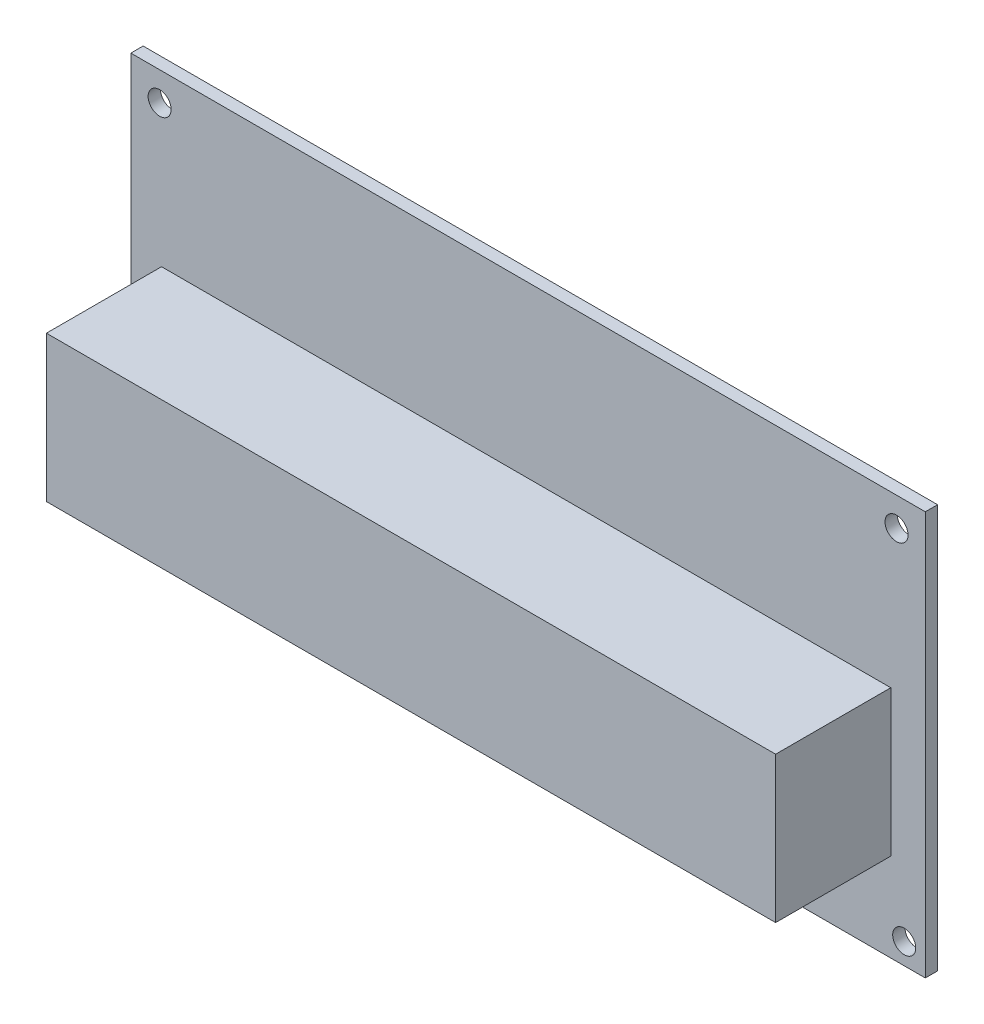
ISO-10303-21;
HEADER;
FILE_DESCRIPTION(('STEP AP214'),'2;1');
FILE_NAME('part.step','',(''),(''),'','','');
FILE_SCHEMA(('AUTOMOTIVE_DESIGN { 1 0 10303 214 1 1 1 1 }'));
ENDSEC;
DATA;
#1=APPLICATION_CONTEXT('core data for automotive mechanical design processes');
#2=APPLICATION_PROTOCOL_DEFINITION('international standard','automotive_design',2000,#1);
#3=PRODUCT_CONTEXT('',#1,'mechanical');
#4=PRODUCT('Part','Part','',(#3));
#5=PRODUCT_RELATED_PRODUCT_CATEGORY('part','',(#4));
#6=PRODUCT_DEFINITION_FORMATION('','',#4);
#7=PRODUCT_DEFINITION_CONTEXT('part definition',#1,'design');
#8=PRODUCT_DEFINITION('design','',#6,#7);
#9=PRODUCT_DEFINITION_SHAPE('','',#8);
#10=(LENGTH_UNIT() NAMED_UNIT(*) SI_UNIT(.MILLI.,.METRE.));
#11=(NAMED_UNIT(*) PLANE_ANGLE_UNIT() SI_UNIT($,.RADIAN.));
#12=(NAMED_UNIT(*) SI_UNIT($,.STERADIAN.) SOLID_ANGLE_UNIT());
#13=UNCERTAINTY_MEASURE_WITH_UNIT(LENGTH_MEASURE(1.E-05),#10,'distance_accuracy_value','');
#14=(GEOMETRIC_REPRESENTATION_CONTEXT(3) GLOBAL_UNCERTAINTY_ASSIGNED_CONTEXT((#13)) GLOBAL_UNIT_ASSIGNED_CONTEXT((#10,
#11,#12)) REPRESENTATION_CONTEXT('',''));
#15=CARTESIAN_POINT('',(0.,0.,0.));
#16=DIRECTION('',(0.,0.,1.));
#17=DIRECTION('',(1.,0.,0.));
#18=AXIS2_PLACEMENT_3D('',#15,#16,#17);
#19=CARTESIAN_POINT('',(0.,0.,1.6));
#20=DIRECTION('',(0.,0.,-1.));
#21=DIRECTION('',(-1.,0.,0.));
#22=AXIS2_PLACEMENT_3D('',#19,#20,#21);
#23=PLANE('',#22);
#24=CARTESIAN_POINT('',(-48.,22.55,1.6));
#25=DIRECTION('',(0.,0.,1.));
#26=DIRECTION('',(-1.,0.,0.));
#27=AXIS2_PLACEMENT_3D('',#24,#25,#26);
#28=CIRCLE('',#27,1.5);
#29=CARTESIAN_POINT('',(-49.5,22.55,1.6));
#30=VERTEX_POINT('',#29);
#31=EDGE_CURVE('E123',#30,#30,#28,.T.);
#32=ORIENTED_EDGE('',*,*,#31,.F.);
#33=EDGE_LOOP('',(#32));
#34=FACE_BOUND('',#33,.T.);
#35=CARTESIAN_POINT('',(-49.,-23.55,1.6));
#36=DIRECTION('',(0.,0.,1.));
#37=DIRECTION('',(1.,0.,0.));
#38=AXIS2_PLACEMENT_3D('',#35,#36,#37);
#39=CIRCLE('',#38,1.5);
#40=CARTESIAN_POINT('',(-47.5,-23.55,1.6));
#41=VERTEX_POINT('',#40);
#42=EDGE_CURVE('E132',#41,#41,#39,.T.);
#43=ORIENTED_EDGE('',*,*,#42,.F.);
#44=EDGE_LOOP('',(#43));
#45=FACE_BOUND('',#44,.T.);
#46=CARTESIAN_POINT('',(49.,-23.55,1.6));
#47=DIRECTION('',(0.,0.,1.));
#48=DIRECTION('',(-1.,0.,0.));
#49=AXIS2_PLACEMENT_3D('',#46,#47,#48);
#50=CIRCLE('',#49,1.5);
#51=CARTESIAN_POINT('',(47.5,-23.55,1.6));
#52=VERTEX_POINT('',#51);
#53=EDGE_CURVE('E138',#52,#52,#50,.T.);
#54=ORIENTED_EDGE('',*,*,#53,.F.);
#55=EDGE_LOOP('',(#54));
#56=FACE_BOUND('',#55,.T.);
#57=CARTESIAN_POINT('',(48.,22.55,1.6));
#58=DIRECTION('',(0.,0.,1.));
#59=DIRECTION('',(1.,0.,0.));
#60=AXIS2_PLACEMENT_3D('',#57,#58,#59);
#61=CIRCLE('',#60,1.5);
#62=CARTESIAN_POINT('',(49.5,22.55,1.6));
#63=VERTEX_POINT('',#62);
#64=EDGE_CURVE('E144',#63,#63,#61,.T.);
#65=ORIENTED_EDGE('',*,*,#64,.F.);
#66=EDGE_LOOP('',(#65));
#67=FACE_BOUND('',#66,.T.);
#68=DIRECTION('',(0.,1.,0.));
#69=VECTOR('',#68,1.);
#70=CARTESIAN_POINT('',(51.75,-26.3,1.6));
#71=LINE('',#70,#69);
#72=CARTESIAN_POINT('',(51.75,-26.3,1.6));
#73=VERTEX_POINT('',#72);
#74=CARTESIAN_POINT('',(51.75,26.3,1.6));
#75=VERTEX_POINT('',#74);
#76=EDGE_CURVE('E150',#73,#75,#71,.T.);
#77=ORIENTED_EDGE('',*,*,#76,.T.);
#78=DIRECTION('',(-1.,0.,0.));
#79=VECTOR('',#78,1.);
#80=CARTESIAN_POINT('',(-51.75,26.3,1.6));
#81=LINE('',#80,#79);
#82=CARTESIAN_POINT('',(-51.75,26.3,1.6));
#83=VERTEX_POINT('',#82);
#84=EDGE_CURVE('E153',#75,#83,#81,.T.);
#85=ORIENTED_EDGE('',*,*,#84,.T.);
#86=DIRECTION('',(0.,-1.,0.));
#87=VECTOR('',#86,1.);
#88=CARTESIAN_POINT('',(-51.75,-26.3,1.6));
#89=LINE('',#88,#87);
#90=CARTESIAN_POINT('',(-51.75,-26.3,1.6));
#91=VERTEX_POINT('',#90);
#92=EDGE_CURVE('E156',#83,#91,#89,.T.);
#93=ORIENTED_EDGE('',*,*,#92,.T.);
#94=DIRECTION('',(1.,0.,0.));
#95=VECTOR('',#94,1.);
#96=CARTESIAN_POINT('',(-51.75,-26.3,1.6));
#97=LINE('',#96,#95);
#98=EDGE_CURVE('E158',#91,#73,#97,.T.);
#99=ORIENTED_EDGE('',*,*,#98,.T.);
#100=EDGE_LOOP('',(#77,#85,#93,#99));
#101=FACE_BOUND('',#100,.T.);
#102=DIRECTION('',(0.,-1.,0.));
#103=VECTOR('',#102,1.);
#104=CARTESIAN_POINT('',(-47.75,-14.8,1.6));
#105=LINE('',#104,#103);
#106=CARTESIAN_POINT('',(-47.75,4.2,1.6));
#107=VERTEX_POINT('',#106);
#108=CARTESIAN_POINT('',(-47.75,-14.8,1.6));
#109=VERTEX_POINT('',#108);
#110=EDGE_CURVE('E50',#107,#109,#105,.T.);
#111=ORIENTED_EDGE('',*,*,#110,.F.);
#112=DIRECTION('',(-1.,0.,0.));
#113=VECTOR('',#112,1.);
#114=CARTESIAN_POINT('',(-47.75,4.2,1.6));
#115=LINE('',#114,#113);
#116=CARTESIAN_POINT('',(47.25,4.2,1.6));
#117=VERTEX_POINT('',#116);
#118=EDGE_CURVE('E54',#117,#107,#115,.T.);
#119=ORIENTED_EDGE('',*,*,#118,.F.);
#120=DIRECTION('',(0.,1.,0.));
#121=VECTOR('',#120,1.);
#122=CARTESIAN_POINT('',(47.25,-14.8,1.6));
#123=LINE('',#122,#121);
#124=CARTESIAN_POINT('',(47.25,-14.8,1.6));
#125=VERTEX_POINT('',#124);
#126=EDGE_CURVE('E337',#125,#117,#123,.T.);
#127=ORIENTED_EDGE('',*,*,#126,.F.);
#128=DIRECTION('',(1.,0.,0.));
#129=VECTOR('',#128,1.);
#130=CARTESIAN_POINT('',(-47.75,-14.8,1.6));
#131=LINE('',#130,#129);
#132=EDGE_CURVE('E343',#109,#125,#131,.T.);
#133=ORIENTED_EDGE('',*,*,#132,.F.);
#134=EDGE_LOOP('',(#111,#119,#127,#133));
#135=FACE_BOUND('',#134,.T.);
#136=ADVANCED_FACE('F35',(#34,#45,#56,#67,#101,#135),#23,.F.);
#137=CARTESIAN_POINT('',(0.,0.,0.));
#138=DIRECTION('',(0.,0.,-1.));
#139=DIRECTION('',(-1.,0.,0.));
#140=AXIS2_PLACEMENT_3D('',#137,#138,#139);
#141=PLANE('',#140);
#142=CARTESIAN_POINT('',(-49.,-23.55,0.));
#143=DIRECTION('',(0.,0.,1.));
#144=DIRECTION('',(1.,0.,0.));
#145=AXIS2_PLACEMENT_3D('',#142,#143,#144);
#146=CIRCLE('',#145,1.5);
#147=CARTESIAN_POINT('',(-47.5,-23.55,0.));
#148=VERTEX_POINT('',#147);
#149=EDGE_CURVE('E130',#148,#148,#146,.T.);
#150=ORIENTED_EDGE('',*,*,#149,.T.);
#151=EDGE_LOOP('',(#150));
#152=FACE_BOUND('',#151,.T.);
#153=CARTESIAN_POINT('',(48.,22.55,0.));
#154=DIRECTION('',(0.,0.,1.));
#155=DIRECTION('',(1.,0.,0.));
#156=AXIS2_PLACEMENT_3D('',#153,#154,#155);
#157=CIRCLE('',#156,1.5);
#158=CARTESIAN_POINT('',(49.5,22.55,0.));
#159=VERTEX_POINT('',#158);
#160=EDGE_CURVE('E141',#159,#159,#157,.T.);
#161=ORIENTED_EDGE('',*,*,#160,.T.);
#162=EDGE_LOOP('',(#161));
#163=FACE_BOUND('',#162,.T.);
#164=DIRECTION('',(0.,1.,0.));
#165=VECTOR('',#164,1.);
#166=CARTESIAN_POINT('',(51.75,-26.3,0.));
#167=LINE('',#166,#165);
#168=CARTESIAN_POINT('',(51.75,-26.3,0.));
#169=VERTEX_POINT('',#168);
#170=CARTESIAN_POINT('',(51.75,26.3,0.));
#171=VERTEX_POINT('',#170);
#172=EDGE_CURVE('E147',#169,#171,#167,.T.);
#173=ORIENTED_EDGE('',*,*,#172,.F.);
#174=DIRECTION('',(1.,0.,0.));
#175=VECTOR('',#174,1.);
#176=CARTESIAN_POINT('',(-51.75,-26.3,0.));
#177=LINE('',#176,#175);
#178=CARTESIAN_POINT('',(-51.75,-26.3,0.));
#179=VERTEX_POINT('',#178);
#180=EDGE_CURVE('E154',#179,#169,#177,.T.);
#181=ORIENTED_EDGE('',*,*,#180,.F.);
#182=DIRECTION('',(0.,-1.,0.));
#183=VECTOR('',#182,1.);
#184=CARTESIAN_POINT('',(-51.75,-26.3,0.));
#185=LINE('',#184,#183);
#186=CARTESIAN_POINT('',(-51.75,26.3,0.));
#187=VERTEX_POINT('',#186);
#188=EDGE_CURVE('E165',#187,#179,#185,.T.);
#189=ORIENTED_EDGE('',*,*,#188,.F.);
#190=DIRECTION('',(-1.,0.,0.));
#191=VECTOR('',#190,1.);
#192=CARTESIAN_POINT('',(-51.75,26.3,0.));
#193=LINE('',#192,#191);
#194=EDGE_CURVE('E163',#171,#187,#193,.T.);
#195=ORIENTED_EDGE('',*,*,#194,.F.);
#196=EDGE_LOOP('',(#173,#181,#189,#195));
#197=FACE_BOUND('',#196,.T.);
#198=CARTESIAN_POINT('',(49.,-23.55,0.));
#199=DIRECTION('',(0.,0.,1.));
#200=DIRECTION('',(-1.,0.,0.));
#201=AXIS2_PLACEMENT_3D('',#198,#199,#200);
#202=CIRCLE('',#201,1.5);
#203=CARTESIAN_POINT('',(47.5,-23.55,0.));
#204=VERTEX_POINT('',#203);
#205=EDGE_CURVE('E135',#204,#204,#202,.T.);
#206=ORIENTED_EDGE('',*,*,#205,.T.);
#207=EDGE_LOOP('',(#206));
#208=FACE_BOUND('',#207,.T.);
#209=CARTESIAN_POINT('',(-48.,22.55,0.));
#210=DIRECTION('',(0.,0.,1.));
#211=DIRECTION('',(-1.,0.,0.));
#212=AXIS2_PLACEMENT_3D('',#209,#210,#211);
#213=CIRCLE('',#212,1.5);
#214=CARTESIAN_POINT('',(-49.5,22.55,0.));
#215=VERTEX_POINT('',#214);
#216=EDGE_CURVE('E120',#215,#215,#213,.T.);
#217=ORIENTED_EDGE('',*,*,#216,.T.);
#218=EDGE_LOOP('',(#217));
#219=FACE_BOUND('',#218,.T.);
#220=ADVANCED_FACE('F183',(#152,#163,#197,#208,#219),#141,.T.);
#221=CARTESIAN_POINT('',(51.75,-26.3,1.6));
#222=DIRECTION('',(-1.,0.,0.));
#223=DIRECTION('',(0.,0.,1.));
#224=AXIS2_PLACEMENT_3D('',#221,#222,#223);
#225=PLANE('',#224);
#226=ORIENTED_EDGE('',*,*,#172,.T.);
#227=DIRECTION('',(0.,0.,-1.));
#228=VECTOR('',#227,1.);
#229=CARTESIAN_POINT('',(51.75,26.3,1.6));
#230=LINE('',#229,#228);
#231=EDGE_CURVE('E11',#75,#171,#230,.T.);
#232=ORIENTED_EDGE('',*,*,#231,.F.);
#233=ORIENTED_EDGE('',*,*,#76,.F.);
#234=DIRECTION('',(0.,0.,-1.));
#235=VECTOR('',#234,1.);
#236=CARTESIAN_POINT('',(51.75,-26.3,1.6));
#237=LINE('',#236,#235);
#238=EDGE_CURVE('E160',#73,#169,#237,.T.);
#239=ORIENTED_EDGE('',*,*,#238,.T.);
#240=EDGE_LOOP('',(#226,#232,#233,#239));
#241=FACE_BOUND('',#240,.T.);
#242=ADVANCED_FACE('F37',(#241),#225,.F.);
#243=CARTESIAN_POINT('',(-51.75,26.3,1.6));
#244=DIRECTION('',(0.,-1.,0.));
#245=DIRECTION('',(0.,0.,-1.));
#246=AXIS2_PLACEMENT_3D('',#243,#244,#245);
#247=PLANE('',#246);
#248=ORIENTED_EDGE('',*,*,#194,.T.);
#249=DIRECTION('',(0.,0.,-1.));
#250=VECTOR('',#249,1.);
#251=CARTESIAN_POINT('',(-51.75,26.3,1.6));
#252=LINE('',#251,#250);
#253=EDGE_CURVE('E43',#83,#187,#252,.T.);
#254=ORIENTED_EDGE('',*,*,#253,.F.);
#255=ORIENTED_EDGE('',*,*,#84,.F.);
#256=ORIENTED_EDGE('',*,*,#231,.T.);
#257=EDGE_LOOP('',(#248,#254,#255,#256));
#258=FACE_BOUND('',#257,.T.);
#259=ADVANCED_FACE('F193',(#258),#247,.F.);
#260=CARTESIAN_POINT('',(-51.75,-26.3,1.6));
#261=DIRECTION('',(1.,0.,0.));
#262=DIRECTION('',(0.,0.,-1.));
#263=AXIS2_PLACEMENT_3D('',#260,#261,#262);
#264=PLANE('',#263);
#265=ORIENTED_EDGE('',*,*,#188,.T.);
#266=DIRECTION('',(0.,0.,-1.));
#267=VECTOR('',#266,1.);
#268=CARTESIAN_POINT('',(-51.75,-26.3,1.6));
#269=LINE('',#268,#267);
#270=EDGE_CURVE('E170',#91,#179,#269,.T.);
#271=ORIENTED_EDGE('',*,*,#270,.F.);
#272=ORIENTED_EDGE('',*,*,#92,.F.);
#273=ORIENTED_EDGE('',*,*,#253,.T.);
#274=EDGE_LOOP('',(#265,#271,#272,#273));
#275=FACE_BOUND('',#274,.T.);
#276=ADVANCED_FACE('F177',(#275),#264,.F.);
#277=CARTESIAN_POINT('',(-51.75,-26.3,1.6));
#278=DIRECTION('',(0.,1.,0.));
#279=DIRECTION('',(0.,0.,1.));
#280=AXIS2_PLACEMENT_3D('',#277,#278,#279);
#281=PLANE('',#280);
#282=ORIENTED_EDGE('',*,*,#180,.T.);
#283=ORIENTED_EDGE('',*,*,#238,.F.);
#284=ORIENTED_EDGE('',*,*,#98,.F.);
#285=ORIENTED_EDGE('',*,*,#270,.T.);
#286=EDGE_LOOP('',(#282,#283,#284,#285));
#287=FACE_BOUND('',#286,.T.);
#288=ADVANCED_FACE('F187',(#287),#281,.F.);
#289=CARTESIAN_POINT('',(48.,22.55,1.6));
#290=DIRECTION('',(0.,0.,-1.));
#291=DIRECTION('',(-1.,0.,0.));
#292=AXIS2_PLACEMENT_3D('',#289,#290,#291);
#293=CYLINDRICAL_SURFACE('',#292,1.5);
#294=ORIENTED_EDGE('',*,*,#64,.T.);
#295=EDGE_LOOP('',(#294));
#296=FACE_BOUND('',#295,.T.);
#297=ORIENTED_EDGE('',*,*,#160,.F.);
#298=EDGE_LOOP('',(#297));
#299=FACE_BOUND('',#298,.T.);
#300=ADVANCED_FACE('F211',(#296,#299),#293,.F.);
#301=CARTESIAN_POINT('',(49.,-23.55,1.6));
#302=DIRECTION('',(0.,0.,-1.));
#303=DIRECTION('',(-1.,0.,0.));
#304=AXIS2_PLACEMENT_3D('',#301,#302,#303);
#305=CYLINDRICAL_SURFACE('',#304,1.5);
#306=ORIENTED_EDGE('',*,*,#53,.T.);
#307=EDGE_LOOP('',(#306));
#308=FACE_BOUND('',#307,.T.);
#309=ORIENTED_EDGE('',*,*,#205,.F.);
#310=EDGE_LOOP('',(#309));
#311=FACE_BOUND('',#310,.T.);
#312=ADVANCED_FACE('F218',(#308,#311),#305,.F.);
#313=CARTESIAN_POINT('',(-49.,-23.55,1.6));
#314=DIRECTION('',(0.,0.,-1.));
#315=DIRECTION('',(-1.,0.,0.));
#316=AXIS2_PLACEMENT_3D('',#313,#314,#315);
#317=CYLINDRICAL_SURFACE('',#316,1.5);
#318=ORIENTED_EDGE('',*,*,#42,.T.);
#319=EDGE_LOOP('',(#318));
#320=FACE_BOUND('',#319,.T.);
#321=ORIENTED_EDGE('',*,*,#149,.F.);
#322=EDGE_LOOP('',(#321));
#323=FACE_BOUND('',#322,.T.);
#324=ADVANCED_FACE('F223',(#320,#323),#317,.F.);
#325=CARTESIAN_POINT('',(-48.,22.55,1.6));
#326=DIRECTION('',(0.,0.,-1.));
#327=DIRECTION('',(-1.,0.,0.));
#328=AXIS2_PLACEMENT_3D('',#325,#326,#327);
#329=CYLINDRICAL_SURFACE('',#328,1.5);
#330=ORIENTED_EDGE('',*,*,#31,.T.);
#331=EDGE_LOOP('',(#330));
#332=FACE_BOUND('',#331,.T.);
#333=ORIENTED_EDGE('',*,*,#216,.F.);
#334=EDGE_LOOP('',(#333));
#335=FACE_BOUND('',#334,.T.);
#336=ADVANCED_FACE('F233',(#332,#335),#329,.F.);
#337=CARTESIAN_POINT('',(-47.75,-14.8,16.6));
#338=DIRECTION('',(1.,0.,0.));
#339=DIRECTION('',(0.,0.,-1.));
#340=AXIS2_PLACEMENT_3D('',#337,#338,#339);
#341=PLANE('',#340);
#342=ORIENTED_EDGE('',*,*,#110,.T.);
#343=DIRECTION('',(0.,0.,-1.));
#344=VECTOR('',#343,1.);
#345=CARTESIAN_POINT('',(-47.75,-14.8,16.6));
#346=LINE('',#345,#344);
#347=CARTESIAN_POINT('',(-47.75,-14.8,16.6));
#348=VERTEX_POINT('',#347);
#349=EDGE_CURVE('E103',#348,#109,#346,.T.);
#350=ORIENTED_EDGE('',*,*,#349,.F.);
#351=DIRECTION('',(0.,-1.,0.));
#352=VECTOR('',#351,1.);
#353=CARTESIAN_POINT('',(-47.75,-14.8,16.6));
#354=LINE('',#353,#352);
#355=CARTESIAN_POINT('',(-47.75,4.2,16.6));
#356=VERTEX_POINT('',#355);
#357=EDGE_CURVE('E109',#356,#348,#354,.T.);
#358=ORIENTED_EDGE('',*,*,#357,.F.);
#359=DIRECTION('',(0.,0.,-1.));
#360=VECTOR('',#359,1.);
#361=CARTESIAN_POINT('',(-47.75,4.2,16.6));
#362=LINE('',#361,#360);
#363=EDGE_CURVE('E335',#356,#107,#362,.T.);
#364=ORIENTED_EDGE('',*,*,#363,.T.);
#365=EDGE_LOOP('',(#342,#350,#358,#364));
#366=FACE_BOUND('',#365,.T.);
#367=ADVANCED_FACE('F119',(#366),#341,.F.);
#368=CARTESIAN_POINT('',(-47.75,-14.8,16.6));
#369=DIRECTION('',(0.,1.,0.));
#370=DIRECTION('',(0.,0.,1.));
#371=AXIS2_PLACEMENT_3D('',#368,#369,#370);
#372=PLANE('',#371);
#373=ORIENTED_EDGE('',*,*,#132,.T.);
#374=DIRECTION('',(0.,0.,-1.));
#375=VECTOR('',#374,1.);
#376=CARTESIAN_POINT('',(47.25,-14.8,16.6));
#377=LINE('',#376,#375);
#378=CARTESIAN_POINT('',(47.25,-14.8,16.6));
#379=VERTEX_POINT('',#378);
#380=EDGE_CURVE('E105',#379,#125,#377,.T.);
#381=ORIENTED_EDGE('',*,*,#380,.F.);
#382=DIRECTION('',(1.,0.,0.));
#383=VECTOR('',#382,1.);
#384=CARTESIAN_POINT('',(-47.75,-14.8,16.6));
#385=LINE('',#384,#383);
#386=EDGE_CURVE('E98',#348,#379,#385,.T.);
#387=ORIENTED_EDGE('',*,*,#386,.F.);
#388=ORIENTED_EDGE('',*,*,#349,.T.);
#389=EDGE_LOOP('',(#373,#381,#387,#388));
#390=FACE_BOUND('',#389,.T.);
#391=ADVANCED_FACE('F101',(#390),#372,.F.);
#392=CARTESIAN_POINT('',(47.25,-14.8,16.6));
#393=DIRECTION('',(-1.,0.,0.));
#394=DIRECTION('',(0.,0.,1.));
#395=AXIS2_PLACEMENT_3D('',#392,#393,#394);
#396=PLANE('',#395);
#397=ORIENTED_EDGE('',*,*,#126,.T.);
#398=DIRECTION('',(0.,0.,-1.));
#399=VECTOR('',#398,1.);
#400=CARTESIAN_POINT('',(47.25,4.2,16.6));
#401=LINE('',#400,#399);
#402=CARTESIAN_POINT('',(47.25,4.2,16.6));
#403=VERTEX_POINT('',#402);
#404=EDGE_CURVE('E125',#403,#117,#401,.T.);
#405=ORIENTED_EDGE('',*,*,#404,.F.);
#406=DIRECTION('',(0.,1.,0.));
#407=VECTOR('',#406,1.);
#408=CARTESIAN_POINT('',(47.25,-14.8,16.6));
#409=LINE('',#408,#407);
#410=EDGE_CURVE('E108',#379,#403,#409,.T.);
#411=ORIENTED_EDGE('',*,*,#410,.F.);
#412=ORIENTED_EDGE('',*,*,#380,.T.);
#413=EDGE_LOOP('',(#397,#405,#411,#412));
#414=FACE_BOUND('',#413,.T.);
#415=ADVANCED_FACE('F245',(#414),#396,.F.);
#416=CARTESIAN_POINT('',(-47.75,4.2,16.6));
#417=DIRECTION('',(0.,-1.,0.));
#418=DIRECTION('',(0.,0.,-1.));
#419=AXIS2_PLACEMENT_3D('',#416,#417,#418);
#420=PLANE('',#419);
#421=ORIENTED_EDGE('',*,*,#118,.T.);
#422=ORIENTED_EDGE('',*,*,#363,.F.);
#423=DIRECTION('',(-1.,0.,0.));
#424=VECTOR('',#423,1.);
#425=CARTESIAN_POINT('',(-47.75,4.2,16.6));
#426=LINE('',#425,#424);
#427=EDGE_CURVE('E114',#403,#356,#426,.T.);
#428=ORIENTED_EDGE('',*,*,#427,.F.);
#429=ORIENTED_EDGE('',*,*,#404,.T.);
#430=EDGE_LOOP('',(#421,#422,#428,#429));
#431=FACE_BOUND('',#430,.T.);
#432=ADVANCED_FACE('F248',(#431),#420,.F.);
#433=CARTESIAN_POINT('',(0.,0.,16.6));
#434=DIRECTION('',(0.,0.,-1.));
#435=DIRECTION('',(-1.,0.,0.));
#436=AXIS2_PLACEMENT_3D('',#433,#434,#435);
#437=PLANE('',#436);
#438=ORIENTED_EDGE('',*,*,#357,.T.);
#439=ORIENTED_EDGE('',*,*,#386,.T.);
#440=ORIENTED_EDGE('',*,*,#410,.T.);
#441=ORIENTED_EDGE('',*,*,#427,.T.);
#442=EDGE_LOOP('',(#438,#439,#440,#441));
#443=FACE_BOUND('',#442,.T.);
#444=ADVANCED_FACE('F112',(#443),#437,.F.);
#445=CLOSED_SHELL('',(#136,#220,#242,#259,#276,#288,#300,#312,#324,#336,#367,#391,#415,#432,#444));
#446=MANIFOLD_SOLID_BREP('B2',#445);
#447=ADVANCED_BREP_SHAPE_REPRESENTATION('',(#18,#446),#14);
#448=SHAPE_DEFINITION_REPRESENTATION(#9,#447);
ENDSEC;
END-ISO-10303-21;
